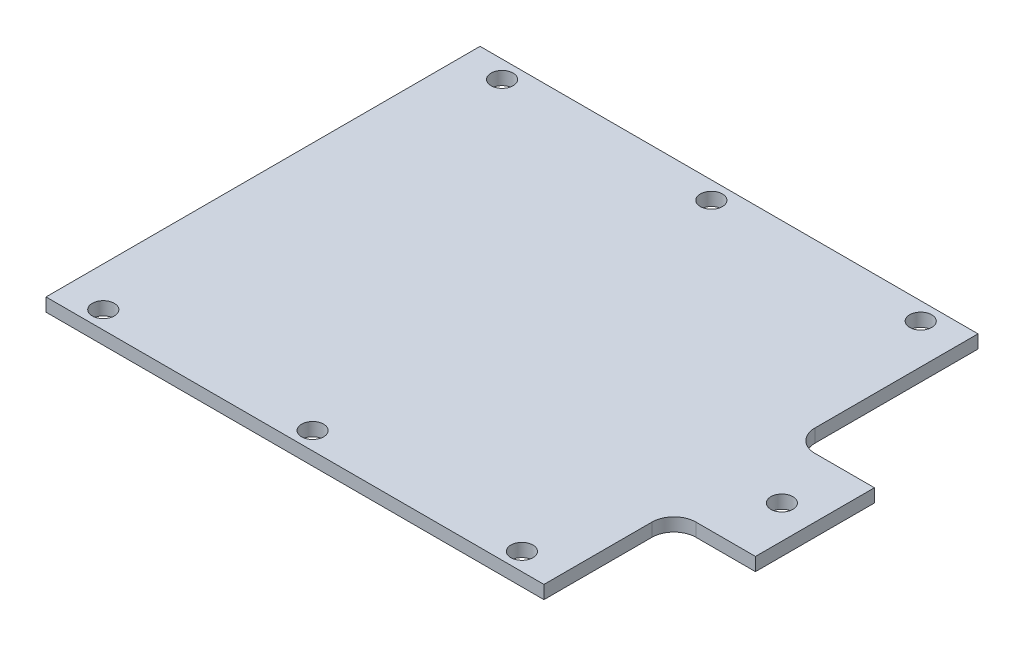
ISO-10303-21;
HEADER;
FILE_DESCRIPTION(('STEP AP214'),'2;1');
FILE_NAME('part.step','',(''),(''),'','','');
FILE_SCHEMA(('AUTOMOTIVE_DESIGN { 1 0 10303 214 1 1 1 1 }'));
ENDSEC;
DATA;
#1=APPLICATION_CONTEXT('core data for automotive mechanical design processes');
#2=APPLICATION_PROTOCOL_DEFINITION('international standard','automotive_design',2000,#1);
#3=PRODUCT_CONTEXT('',#1,'mechanical');
#4=PRODUCT('Part','Part','',(#3));
#5=PRODUCT_RELATED_PRODUCT_CATEGORY('part','',(#4));
#6=PRODUCT_DEFINITION_FORMATION('','',#4);
#7=PRODUCT_DEFINITION_CONTEXT('part definition',#1,'design');
#8=PRODUCT_DEFINITION('design','',#6,#7);
#9=PRODUCT_DEFINITION_SHAPE('','',#8);
#10=(LENGTH_UNIT() NAMED_UNIT(*) SI_UNIT(.MILLI.,.METRE.));
#11=(NAMED_UNIT(*) PLANE_ANGLE_UNIT() SI_UNIT($,.RADIAN.));
#12=(NAMED_UNIT(*) SI_UNIT($,.STERADIAN.) SOLID_ANGLE_UNIT());
#13=UNCERTAINTY_MEASURE_WITH_UNIT(LENGTH_MEASURE(1.E-05),#10,'distance_accuracy_value','');
#14=(GEOMETRIC_REPRESENTATION_CONTEXT(3) GLOBAL_UNCERTAINTY_ASSIGNED_CONTEXT((#13)) GLOBAL_UNIT_ASSIGNED_CONTEXT((#10,
#11,#12)) REPRESENTATION_CONTEXT('',''));
#15=CARTESIAN_POINT('',(0.,0.,0.));
#16=DIRECTION('',(0.,0.,1.));
#17=DIRECTION('',(1.,0.,0.));
#18=AXIS2_PLACEMENT_3D('',#15,#16,#17);
#19=CARTESIAN_POINT('',(0.,0.,0.));
#20=DIRECTION('',(0.,1.,0.));
#21=DIRECTION('',(0.,0.,1.));
#22=AXIS2_PLACEMENT_3D('',#19,#20,#21);
#23=PLANE('',#22);
#24=CARTESIAN_POINT('',(95.,0.,90.5));
#25=DIRECTION('',(0.,1.,0.));
#26=DIRECTION('',(0.,0.,1.));
#27=AXIS2_PLACEMENT_3D('',#24,#25,#26);
#28=CIRCLE('',#27,5.);
#29=CARTESIAN_POINT('',(95.,0.,95.5));
#30=VERTEX_POINT('',#29);
#31=EDGE_CURVE('E125',#30,#30,#28,.T.);
#32=ORIENTED_EDGE('',*,*,#31,.T.);
#33=EDGE_LOOP('',(#32));
#34=FACE_BOUND('',#33,.T.);
#35=CARTESIAN_POINT('',(0.,0.,90.5));
#36=DIRECTION('',(0.,1.,0.));
#37=DIRECTION('',(0.,0.,1.));
#38=AXIS2_PLACEMENT_3D('',#35,#36,#37);
#39=CIRCLE('',#38,5.);
#40=CARTESIAN_POINT('',(0.,0.,95.5));
#41=VERTEX_POINT('',#40);
#42=EDGE_CURVE('E201',#41,#41,#39,.T.);
#43=ORIENTED_EDGE('',*,*,#42,.T.);
#44=EDGE_LOOP('',(#43));
#45=FACE_BOUND('',#44,.T.);
#46=CARTESIAN_POINT('',(-95.,0.,90.5));
#47=DIRECTION('',(0.,1.,0.));
#48=DIRECTION('',(0.,0.,1.));
#49=AXIS2_PLACEMENT_3D('',#46,#47,#48);
#50=CIRCLE('',#49,5.);
#51=CARTESIAN_POINT('',(-95.,0.,95.5));
#52=VERTEX_POINT('',#51);
#53=EDGE_CURVE('E204',#52,#52,#50,.T.);
#54=ORIENTED_EDGE('',*,*,#53,.T.);
#55=EDGE_LOOP('',(#54));
#56=FACE_BOUND('',#55,.T.);
#57=CARTESIAN_POINT('',(135.,0.,12.5));
#58=DIRECTION('',(0.,1.,0.));
#59=DIRECTION('',(0.,0.,1.));
#60=AXIS2_PLACEMENT_3D('',#57,#58,#59);
#61=CIRCLE('',#60,5.);
#62=CARTESIAN_POINT('',(135.,0.,17.5));
#63=VERTEX_POINT('',#62);
#64=EDGE_CURVE('E207',#63,#63,#61,.T.);
#65=ORIENTED_EDGE('',*,*,#64,.T.);
#66=EDGE_LOOP('',(#65));
#67=FACE_BOUND('',#66,.T.);
#68=CARTESIAN_POINT('',(95.,0.,-90.5));
#69=DIRECTION('',(0.,1.,0.));
#70=DIRECTION('',(0.,0.,1.));
#71=AXIS2_PLACEMENT_3D('',#68,#69,#70);
#72=CIRCLE('',#71,5.);
#73=CARTESIAN_POINT('',(95.,0.,-85.5));
#74=VERTEX_POINT('',#73);
#75=EDGE_CURVE('E210',#74,#74,#72,.T.);
#76=ORIENTED_EDGE('',*,*,#75,.T.);
#77=EDGE_LOOP('',(#76));
#78=FACE_BOUND('',#77,.T.);
#79=CARTESIAN_POINT('',(0.,0.,-90.5));
#80=DIRECTION('',(0.,1.,0.));
#81=DIRECTION('',(0.,0.,1.));
#82=AXIS2_PLACEMENT_3D('',#79,#80,#81);
#83=CIRCLE('',#82,5.);
#84=CARTESIAN_POINT('',(0.,0.,-85.5));
#85=VERTEX_POINT('',#84);
#86=EDGE_CURVE('E213',#85,#85,#83,.T.);
#87=ORIENTED_EDGE('',*,*,#86,.T.);
#88=EDGE_LOOP('',(#87));
#89=FACE_BOUND('',#88,.T.);
#90=CARTESIAN_POINT('',(-95.,0.,-90.5));
#91=DIRECTION('',(0.,1.,0.));
#92=DIRECTION('',(0.,0.,1.));
#93=AXIS2_PLACEMENT_3D('',#90,#91,#92);
#94=CIRCLE('',#93,5.);
#95=CARTESIAN_POINT('',(-95.,0.,-85.5));
#96=VERTEX_POINT('',#95);
#97=EDGE_CURVE('E147',#96,#96,#94,.T.);
#98=ORIENTED_EDGE('',*,*,#97,.T.);
#99=EDGE_LOOP('',(#98));
#100=FACE_BOUND('',#99,.T.);
#101=DIRECTION('',(0.,0.,-1.));
#102=VECTOR('',#101,1.);
#103=CARTESIAN_POINT('',(113.,0.,-24.5));
#104=LINE('',#103,#102);
#105=CARTESIAN_POINT('',(113.,0.,-24.5));
#106=VERTEX_POINT('',#105);
#107=CARTESIAN_POINT('',(113.,0.,-98.5));
#108=VERTEX_POINT('',#107);
#109=EDGE_CURVE('E150',#106,#108,#104,.T.);
#110=ORIENTED_EDGE('',*,*,#109,.F.);
#111=CARTESIAN_POINT('',(123.,0.,-24.5));
#112=DIRECTION('',(0.,1.,0.));
#113=DIRECTION('',(0.,0.,1.));
#114=AXIS2_PLACEMENT_3D('',#111,#112,#113);
#115=CIRCLE('',#114,10.);
#116=CARTESIAN_POINT('',(123.,0.,-14.5));
#117=VERTEX_POINT('',#116);
#118=EDGE_CURVE('E162',#106,#117,#115,.T.);
#119=ORIENTED_EDGE('',*,*,#118,.T.);
#120=DIRECTION('',(-1.,0.,0.));
#121=VECTOR('',#120,1.);
#122=CARTESIAN_POINT('',(150.,0.,-14.5));
#123=LINE('',#122,#121);
#124=CARTESIAN_POINT('',(150.,0.,-14.5));
#125=VERTEX_POINT('',#124);
#126=EDGE_CURVE('E159',#125,#117,#123,.T.);
#127=ORIENTED_EDGE('',*,*,#126,.F.);
#128=DIRECTION('',(0.,0.,-1.));
#129=VECTOR('',#128,1.);
#130=CARTESIAN_POINT('',(150.,0.,39.5));
#131=LINE('',#130,#129);
#132=CARTESIAN_POINT('',(150.,0.,39.5));
#133=VERTEX_POINT('',#132);
#134=EDGE_CURVE('E166',#133,#125,#131,.T.);
#135=ORIENTED_EDGE('',*,*,#134,.F.);
#136=DIRECTION('',(1.,0.,0.));
#137=VECTOR('',#136,1.);
#138=CARTESIAN_POINT('',(123.,0.,39.5));
#139=LINE('',#138,#137);
#140=CARTESIAN_POINT('',(123.,0.,39.5));
#141=VERTEX_POINT('',#140);
#142=EDGE_CURVE('E99',#141,#133,#139,.T.);
#143=ORIENTED_EDGE('',*,*,#142,.F.);
#144=CARTESIAN_POINT('',(123.,0.,49.5));
#145=DIRECTION('',(0.,1.,0.));
#146=DIRECTION('',(0.,0.,1.));
#147=AXIS2_PLACEMENT_3D('',#144,#145,#146);
#148=CIRCLE('',#147,10.);
#149=CARTESIAN_POINT('',(113.,0.,49.5));
#150=VERTEX_POINT('',#149);
#151=EDGE_CURVE('E20',#141,#150,#148,.T.);
#152=ORIENTED_EDGE('',*,*,#151,.T.);
#153=DIRECTION('',(0.,0.,-1.));
#154=VECTOR('',#153,1.);
#155=CARTESIAN_POINT('',(113.,0.,98.5));
#156=LINE('',#155,#154);
#157=CARTESIAN_POINT('',(113.,0.,98.5));
#158=VERTEX_POINT('',#157);
#159=EDGE_CURVE('E96',#158,#150,#156,.T.);
#160=ORIENTED_EDGE('',*,*,#159,.F.);
#161=DIRECTION('',(1.,0.,0.));
#162=VECTOR('',#161,1.);
#163=CARTESIAN_POINT('',(-113.,0.,98.5));
#164=LINE('',#163,#162);
#165=CARTESIAN_POINT('',(-113.,0.,98.5));
#166=VERTEX_POINT('',#165);
#167=EDGE_CURVE('E118',#166,#158,#164,.T.);
#168=ORIENTED_EDGE('',*,*,#167,.F.);
#169=DIRECTION('',(0.,0.,1.));
#170=VECTOR('',#169,1.);
#171=CARTESIAN_POINT('',(-113.,0.,-98.5));
#172=LINE('',#171,#170);
#173=CARTESIAN_POINT('',(-113.,0.,-98.5));
#174=VERTEX_POINT('',#173);
#175=EDGE_CURVE('E144',#174,#166,#172,.T.);
#176=ORIENTED_EDGE('',*,*,#175,.F.);
#177=DIRECTION('',(-1.,0.,0.));
#178=VECTOR('',#177,1.);
#179=CARTESIAN_POINT('',(113.,0.,-98.5));
#180=LINE('',#179,#178);
#181=EDGE_CURVE('E131',#108,#174,#180,.T.);
#182=ORIENTED_EDGE('',*,*,#181,.F.);
#183=EDGE_LOOP('',(#110,#119,#127,#135,#143,#152,#160,#168,#176,#182));
#184=FACE_BOUND('',#183,.T.);
#185=ADVANCED_FACE('F17',(#34,#45,#56,#67,#78,#89,#100,#184),#23,.F.);
#186=CARTESIAN_POINT('',(-113.,0.,98.5));
#187=DIRECTION('',(0.,0.,1.));
#188=DIRECTION('',(1.,0.,0.));
#189=AXIS2_PLACEMENT_3D('',#186,#187,#188);
#190=PLANE('',#189);
#191=DIRECTION('',(0.,1.,0.));
#192=VECTOR('',#191,1.);
#193=CARTESIAN_POINT('',(-113.,0.,98.5));
#194=LINE('',#193,#192);
#195=CARTESIAN_POINT('',(-113.,6.,98.5));
#196=VERTEX_POINT('',#195);
#197=EDGE_CURVE('E128',#166,#196,#194,.T.);
#198=ORIENTED_EDGE('',*,*,#197,.F.);
#199=ORIENTED_EDGE('',*,*,#167,.T.);
#200=DIRECTION('',(0.,1.,0.));
#201=VECTOR('',#200,1.);
#202=CARTESIAN_POINT('',(113.,0.,98.5));
#203=LINE('',#202,#201);
#204=CARTESIAN_POINT('',(113.,6.,98.5));
#205=VERTEX_POINT('',#204);
#206=EDGE_CURVE('E106',#205,#158,#203,.F.);
#207=ORIENTED_EDGE('',*,*,#206,.F.);
#208=DIRECTION('',(1.,0.,0.));
#209=VECTOR('',#208,1.);
#210=CARTESIAN_POINT('',(0.,6.,98.5));
#211=LINE('',#210,#209);
#212=EDGE_CURVE('E121',#196,#205,#211,.T.);
#213=ORIENTED_EDGE('',*,*,#212,.F.);
#214=EDGE_LOOP('',(#198,#199,#207,#213));
#215=FACE_BOUND('',#214,.T.);
#216=ADVANCED_FACE('F436',(#215),#190,.T.);
#217=CARTESIAN_POINT('',(113.,0.,98.5));
#218=DIRECTION('',(1.,0.,0.));
#219=DIRECTION('',(0.,0.,-1.));
#220=AXIS2_PLACEMENT_3D('',#217,#218,#219);
#221=PLANE('',#220);
#222=ORIENTED_EDGE('',*,*,#206,.T.);
#223=ORIENTED_EDGE('',*,*,#159,.T.);
#224=DIRECTION('',(0.,1.,0.));
#225=VECTOR('',#224,1.);
#226=CARTESIAN_POINT('',(113.,0.,49.5));
#227=LINE('',#226,#225);
#228=CARTESIAN_POINT('',(113.,6.,49.5));
#229=VERTEX_POINT('',#228);
#230=EDGE_CURVE('E101',#150,#229,#227,.T.);
#231=ORIENTED_EDGE('',*,*,#230,.T.);
#232=DIRECTION('',(0.,0.,1.));
#233=VECTOR('',#232,1.);
#234=CARTESIAN_POINT('',(113.,6.,0.));
#235=LINE('',#234,#233);
#236=EDGE_CURVE('E124',#205,#229,#235,.F.);
#237=ORIENTED_EDGE('',*,*,#236,.F.);
#238=EDGE_LOOP('',(#222,#223,#231,#237));
#239=FACE_BOUND('',#238,.T.);
#240=ADVANCED_FACE('F103',(#239),#221,.T.);
#241=CARTESIAN_POINT('',(123.,0.,49.5));
#242=DIRECTION('',(0.,1.,0.));
#243=DIRECTION('',(0.,0.,1.));
#244=AXIS2_PLACEMENT_3D('',#241,#242,#243);
#245=CYLINDRICAL_SURFACE('',#244,10.);
#246=CARTESIAN_POINT('',(123.,6.,49.5));
#247=DIRECTION('',(0.,1.,0.));
#248=DIRECTION('',(0.,0.,1.));
#249=AXIS2_PLACEMENT_3D('',#246,#247,#248);
#250=CIRCLE('',#249,10.);
#251=CARTESIAN_POINT('',(123.,6.,39.5));
#252=VERTEX_POINT('',#251);
#253=EDGE_CURVE('E110',#229,#252,#250,.F.);
#254=ORIENTED_EDGE('',*,*,#253,.F.);
#255=ORIENTED_EDGE('',*,*,#230,.F.);
#256=ORIENTED_EDGE('',*,*,#151,.F.);
#257=DIRECTION('',(0.,1.,0.));
#258=VECTOR('',#257,1.);
#259=CARTESIAN_POINT('',(123.,0.,39.5));
#260=LINE('',#259,#258);
#261=EDGE_CURVE('E112',#252,#141,#260,.F.);
#262=ORIENTED_EDGE('',*,*,#261,.F.);
#263=EDGE_LOOP('',(#254,#255,#256,#262));
#264=FACE_BOUND('',#263,.T.);
#265=ADVANCED_FACE('F108',(#264),#245,.F.);
#266=CARTESIAN_POINT('',(123.,0.,39.5));
#267=DIRECTION('',(0.,0.,1.));
#268=DIRECTION('',(1.,0.,0.));
#269=AXIS2_PLACEMENT_3D('',#266,#267,#268);
#270=PLANE('',#269);
#271=ORIENTED_EDGE('',*,*,#261,.T.);
#272=ORIENTED_EDGE('',*,*,#142,.T.);
#273=DIRECTION('',(0.,1.,0.));
#274=VECTOR('',#273,1.);
#275=CARTESIAN_POINT('',(150.,0.,39.5));
#276=LINE('',#275,#274);
#277=CARTESIAN_POINT('',(150.,6.,39.5));
#278=VERTEX_POINT('',#277);
#279=EDGE_CURVE('E168',#278,#133,#276,.F.);
#280=ORIENTED_EDGE('',*,*,#279,.F.);
#281=DIRECTION('',(1.,0.,0.));
#282=VECTOR('',#281,1.);
#283=CARTESIAN_POINT('',(0.,6.,39.5));
#284=LINE('',#283,#282);
#285=EDGE_CURVE('E198',#252,#278,#284,.T.);
#286=ORIENTED_EDGE('',*,*,#285,.F.);
#287=EDGE_LOOP('',(#271,#272,#280,#286));
#288=FACE_BOUND('',#287,.T.);
#289=ADVANCED_FACE('F247',(#288),#270,.T.);
#290=CARTESIAN_POINT('',(150.,0.,39.5));
#291=DIRECTION('',(1.,0.,0.));
#292=DIRECTION('',(0.,0.,-1.));
#293=AXIS2_PLACEMENT_3D('',#290,#291,#292);
#294=PLANE('',#293);
#295=ORIENTED_EDGE('',*,*,#279,.T.);
#296=ORIENTED_EDGE('',*,*,#134,.T.);
#297=DIRECTION('',(0.,1.,0.));
#298=VECTOR('',#297,1.);
#299=CARTESIAN_POINT('',(150.,0.,-14.5));
#300=LINE('',#299,#298);
#301=CARTESIAN_POINT('',(150.,6.,-14.5));
#302=VERTEX_POINT('',#301);
#303=EDGE_CURVE('E163',#302,#125,#300,.F.);
#304=ORIENTED_EDGE('',*,*,#303,.F.);
#305=DIRECTION('',(0.,0.,1.));
#306=VECTOR('',#305,1.);
#307=CARTESIAN_POINT('',(150.,6.,0.));
#308=LINE('',#307,#306);
#309=EDGE_CURVE('E234',#278,#302,#308,.F.);
#310=ORIENTED_EDGE('',*,*,#309,.F.);
#311=EDGE_LOOP('',(#295,#296,#304,#310));
#312=FACE_BOUND('',#311,.T.);
#313=ADVANCED_FACE('F243',(#312),#294,.T.);
#314=CARTESIAN_POINT('',(150.,0.,-14.5));
#315=DIRECTION('',(0.,0.,-1.));
#316=DIRECTION('',(-1.,0.,0.));
#317=AXIS2_PLACEMENT_3D('',#314,#315,#316);
#318=PLANE('',#317);
#319=ORIENTED_EDGE('',*,*,#303,.T.);
#320=ORIENTED_EDGE('',*,*,#126,.T.);
#321=DIRECTION('',(0.,1.,0.));
#322=VECTOR('',#321,1.);
#323=CARTESIAN_POINT('',(123.,0.,-14.5));
#324=LINE('',#323,#322);
#325=CARTESIAN_POINT('',(123.,6.,-14.5));
#326=VERTEX_POINT('',#325);
#327=EDGE_CURVE('E217',#117,#326,#324,.T.);
#328=ORIENTED_EDGE('',*,*,#327,.T.);
#329=DIRECTION('',(1.,0.,0.));
#330=VECTOR('',#329,1.);
#331=CARTESIAN_POINT('',(0.,6.,-14.5));
#332=LINE('',#331,#330);
#333=EDGE_CURVE('E196',#302,#326,#332,.F.);
#334=ORIENTED_EDGE('',*,*,#333,.F.);
#335=EDGE_LOOP('',(#319,#320,#328,#334));
#336=FACE_BOUND('',#335,.T.);
#337=ADVANCED_FACE('F248',(#336),#318,.T.);
#338=CARTESIAN_POINT('',(123.,0.,-24.5));
#339=DIRECTION('',(0.,1.,0.));
#340=DIRECTION('',(0.,0.,1.));
#341=AXIS2_PLACEMENT_3D('',#338,#339,#340);
#342=CYLINDRICAL_SURFACE('',#341,10.);
#343=CARTESIAN_POINT('',(123.,6.,-24.5));
#344=DIRECTION('',(0.,1.,0.));
#345=DIRECTION('',(0.,0.,1.));
#346=AXIS2_PLACEMENT_3D('',#343,#344,#345);
#347=CIRCLE('',#346,10.);
#348=CARTESIAN_POINT('',(113.,6.,-24.5));
#349=VERTEX_POINT('',#348);
#350=EDGE_CURVE('E192',#326,#349,#347,.F.);
#351=ORIENTED_EDGE('',*,*,#350,.F.);
#352=ORIENTED_EDGE('',*,*,#327,.F.);
#353=ORIENTED_EDGE('',*,*,#118,.F.);
#354=DIRECTION('',(0.,1.,0.));
#355=VECTOR('',#354,1.);
#356=CARTESIAN_POINT('',(113.,0.,-24.5));
#357=LINE('',#356,#355);
#358=EDGE_CURVE('E153',#349,#106,#357,.F.);
#359=ORIENTED_EDGE('',*,*,#358,.F.);
#360=EDGE_LOOP('',(#351,#352,#353,#359));
#361=FACE_BOUND('',#360,.T.);
#362=ADVANCED_FACE('F281',(#361),#342,.F.);
#363=CARTESIAN_POINT('',(113.,0.,-24.5));
#364=DIRECTION('',(1.,0.,0.));
#365=DIRECTION('',(0.,0.,-1.));
#366=AXIS2_PLACEMENT_3D('',#363,#364,#365);
#367=PLANE('',#366);
#368=ORIENTED_EDGE('',*,*,#358,.T.);
#369=ORIENTED_EDGE('',*,*,#109,.T.);
#370=DIRECTION('',(0.,1.,0.));
#371=VECTOR('',#370,1.);
#372=CARTESIAN_POINT('',(113.,0.,-98.5));
#373=LINE('',#372,#371);
#374=CARTESIAN_POINT('',(113.,6.,-98.5));
#375=VERTEX_POINT('',#374);
#376=EDGE_CURVE('E152',#375,#108,#373,.F.);
#377=ORIENTED_EDGE('',*,*,#376,.F.);
#378=DIRECTION('',(0.,0.,1.));
#379=VECTOR('',#378,1.);
#380=CARTESIAN_POINT('',(113.,6.,0.));
#381=LINE('',#380,#379);
#382=EDGE_CURVE('E195',#349,#375,#381,.F.);
#383=ORIENTED_EDGE('',*,*,#382,.F.);
#384=EDGE_LOOP('',(#368,#369,#377,#383));
#385=FACE_BOUND('',#384,.T.);
#386=ADVANCED_FACE('F273',(#385),#367,.T.);
#387=CARTESIAN_POINT('',(113.,0.,-98.5));
#388=DIRECTION('',(0.,0.,-1.));
#389=DIRECTION('',(-1.,0.,0.));
#390=AXIS2_PLACEMENT_3D('',#387,#388,#389);
#391=PLANE('',#390);
#392=ORIENTED_EDGE('',*,*,#376,.T.);
#393=ORIENTED_EDGE('',*,*,#181,.T.);
#394=DIRECTION('',(0.,1.,0.));
#395=VECTOR('',#394,1.);
#396=CARTESIAN_POINT('',(-113.,0.,-98.5));
#397=LINE('',#396,#395);
#398=CARTESIAN_POINT('',(-113.,6.,-98.5));
#399=VERTEX_POINT('',#398);
#400=EDGE_CURVE('E35',#399,#174,#397,.F.);
#401=ORIENTED_EDGE('',*,*,#400,.F.);
#402=DIRECTION('',(1.,0.,0.));
#403=VECTOR('',#402,1.);
#404=CARTESIAN_POINT('',(0.,6.,-98.5));
#405=LINE('',#404,#403);
#406=EDGE_CURVE('E138',#375,#399,#405,.F.);
#407=ORIENTED_EDGE('',*,*,#406,.F.);
#408=EDGE_LOOP('',(#392,#393,#401,#407));
#409=FACE_BOUND('',#408,.T.);
#410=ADVANCED_FACE('F267',(#409),#391,.T.);
#411=CARTESIAN_POINT('',(-113.,0.,-98.5));
#412=DIRECTION('',(-1.,0.,0.));
#413=DIRECTION('',(0.,0.,1.));
#414=AXIS2_PLACEMENT_3D('',#411,#412,#413);
#415=PLANE('',#414);
#416=ORIENTED_EDGE('',*,*,#400,.T.);
#417=ORIENTED_EDGE('',*,*,#175,.T.);
#418=ORIENTED_EDGE('',*,*,#197,.T.);
#419=DIRECTION('',(0.,0.,1.));
#420=VECTOR('',#419,1.);
#421=CARTESIAN_POINT('',(-113.,6.,0.));
#422=LINE('',#421,#420);
#423=EDGE_CURVE('E134',#399,#196,#422,.T.);
#424=ORIENTED_EDGE('',*,*,#423,.F.);
#425=EDGE_LOOP('',(#416,#417,#418,#424));
#426=FACE_BOUND('',#425,.T.);
#427=ADVANCED_FACE('F276',(#426),#415,.T.);
#428=CARTESIAN_POINT('',(-95.,0.,-90.5));
#429=DIRECTION('',(0.,1.,0.));
#430=DIRECTION('',(0.,0.,1.));
#431=AXIS2_PLACEMENT_3D('',#428,#429,#430);
#432=CYLINDRICAL_SURFACE('',#431,5.);
#433=CARTESIAN_POINT('',(-95.,6.,-90.5));
#434=DIRECTION('',(0.,1.,0.));
#435=DIRECTION('',(0.,0.,1.));
#436=AXIS2_PLACEMENT_3D('',#433,#434,#435);
#437=CIRCLE('',#436,5.);
#438=CARTESIAN_POINT('',(-95.,6.,-85.5));
#439=VERTEX_POINT('',#438);
#440=EDGE_CURVE('E137',#439,#439,#437,.F.);
#441=ORIENTED_EDGE('',*,*,#440,.F.);
#442=EDGE_LOOP('',(#441));
#443=FACE_BOUND('',#442,.T.);
#444=ORIENTED_EDGE('',*,*,#97,.F.);
#445=EDGE_LOOP('',(#444));
#446=FACE_BOUND('',#445,.T.);
#447=ADVANCED_FACE('F321',(#443,#446),#432,.F.);
#448=CARTESIAN_POINT('',(0.,0.,-90.5));
#449=DIRECTION('',(0.,1.,0.));
#450=DIRECTION('',(0.,0.,1.));
#451=AXIS2_PLACEMENT_3D('',#448,#449,#450);
#452=CYLINDRICAL_SURFACE('',#451,5.);
#453=CARTESIAN_POINT('',(0.,6.,-90.5));
#454=DIRECTION('',(0.,1.,0.));
#455=DIRECTION('',(0.,0.,1.));
#456=AXIS2_PLACEMENT_3D('',#453,#454,#455);
#457=CIRCLE('',#456,5.);
#458=CARTESIAN_POINT('',(0.,6.,-85.5));
#459=VERTEX_POINT('',#458);
#460=EDGE_CURVE('E187',#459,#459,#457,.F.);
#461=ORIENTED_EDGE('',*,*,#460,.F.);
#462=EDGE_LOOP('',(#461));
#463=FACE_BOUND('',#462,.T.);
#464=ORIENTED_EDGE('',*,*,#86,.F.);
#465=EDGE_LOOP('',(#464));
#466=FACE_BOUND('',#465,.T.);
#467=ADVANCED_FACE('F317',(#463,#466),#452,.F.);
#468=CARTESIAN_POINT('',(95.,0.,-90.5));
#469=DIRECTION('',(0.,1.,0.));
#470=DIRECTION('',(0.,0.,1.));
#471=AXIS2_PLACEMENT_3D('',#468,#469,#470);
#472=CYLINDRICAL_SURFACE('',#471,5.);
#473=CARTESIAN_POINT('',(95.,6.,-90.5));
#474=DIRECTION('',(0.,1.,0.));
#475=DIRECTION('',(0.,0.,1.));
#476=AXIS2_PLACEMENT_3D('',#473,#474,#475);
#477=CIRCLE('',#476,5.);
#478=CARTESIAN_POINT('',(95.,6.,-85.5));
#479=VERTEX_POINT('',#478);
#480=EDGE_CURVE('E184',#479,#479,#477,.F.);
#481=ORIENTED_EDGE('',*,*,#480,.F.);
#482=EDGE_LOOP('',(#481));
#483=FACE_BOUND('',#482,.T.);
#484=ORIENTED_EDGE('',*,*,#75,.F.);
#485=EDGE_LOOP('',(#484));
#486=FACE_BOUND('',#485,.T.);
#487=ADVANCED_FACE('F313',(#483,#486),#472,.F.);
#488=CARTESIAN_POINT('',(135.,0.,12.5));
#489=DIRECTION('',(0.,1.,0.));
#490=DIRECTION('',(0.,0.,1.));
#491=AXIS2_PLACEMENT_3D('',#488,#489,#490);
#492=CYLINDRICAL_SURFACE('',#491,5.);
#493=CARTESIAN_POINT('',(135.,6.,12.5));
#494=DIRECTION('',(0.,1.,0.));
#495=DIRECTION('',(0.,0.,1.));
#496=AXIS2_PLACEMENT_3D('',#493,#494,#495);
#497=CIRCLE('',#496,5.);
#498=CARTESIAN_POINT('',(135.,6.,17.5));
#499=VERTEX_POINT('',#498);
#500=EDGE_CURVE('E181',#499,#499,#497,.F.);
#501=ORIENTED_EDGE('',*,*,#500,.F.);
#502=EDGE_LOOP('',(#501));
#503=FACE_BOUND('',#502,.T.);
#504=ORIENTED_EDGE('',*,*,#64,.F.);
#505=EDGE_LOOP('',(#504));
#506=FACE_BOUND('',#505,.T.);
#507=ADVANCED_FACE('F309',(#503,#506),#492,.F.);
#508=CARTESIAN_POINT('',(-95.,0.,90.5));
#509=DIRECTION('',(0.,1.,0.));
#510=DIRECTION('',(0.,0.,1.));
#511=AXIS2_PLACEMENT_3D('',#508,#509,#510);
#512=CYLINDRICAL_SURFACE('',#511,5.);
#513=CARTESIAN_POINT('',(-95.,6.,90.5));
#514=DIRECTION('',(0.,1.,0.));
#515=DIRECTION('',(0.,0.,1.));
#516=AXIS2_PLACEMENT_3D('',#513,#514,#515);
#517=CIRCLE('',#516,5.);
#518=CARTESIAN_POINT('',(-95.,6.,95.5));
#519=VERTEX_POINT('',#518);
#520=EDGE_CURVE('E178',#519,#519,#517,.F.);
#521=ORIENTED_EDGE('',*,*,#520,.F.);
#522=EDGE_LOOP('',(#521));
#523=FACE_BOUND('',#522,.T.);
#524=ORIENTED_EDGE('',*,*,#53,.F.);
#525=EDGE_LOOP('',(#524));
#526=FACE_BOUND('',#525,.T.);
#527=ADVANCED_FACE('F305',(#523,#526),#512,.F.);
#528=CARTESIAN_POINT('',(0.,0.,90.5));
#529=DIRECTION('',(0.,1.,0.));
#530=DIRECTION('',(0.,0.,1.));
#531=AXIS2_PLACEMENT_3D('',#528,#529,#530);
#532=CYLINDRICAL_SURFACE('',#531,5.);
#533=CARTESIAN_POINT('',(0.,6.,90.5));
#534=DIRECTION('',(0.,1.,0.));
#535=DIRECTION('',(0.,0.,1.));
#536=AXIS2_PLACEMENT_3D('',#533,#534,#535);
#537=CIRCLE('',#536,5.);
#538=CARTESIAN_POINT('',(0.,6.,95.5));
#539=VERTEX_POINT('',#538);
#540=EDGE_CURVE('E26',#539,#539,#537,.F.);
#541=ORIENTED_EDGE('',*,*,#540,.F.);
#542=EDGE_LOOP('',(#541));
#543=FACE_BOUND('',#542,.T.);
#544=ORIENTED_EDGE('',*,*,#42,.F.);
#545=EDGE_LOOP('',(#544));
#546=FACE_BOUND('',#545,.T.);
#547=ADVANCED_FACE('F298',(#543,#546),#532,.F.);
#548=CARTESIAN_POINT('',(95.,0.,90.5));
#549=DIRECTION('',(0.,1.,0.));
#550=DIRECTION('',(0.,0.,1.));
#551=AXIS2_PLACEMENT_3D('',#548,#549,#550);
#552=CYLINDRICAL_SURFACE('',#551,5.);
#553=CARTESIAN_POINT('',(95.,6.,90.5));
#554=DIRECTION('',(0.,1.,0.));
#555=DIRECTION('',(0.,0.,1.));
#556=AXIS2_PLACEMENT_3D('',#553,#554,#555);
#557=CIRCLE('',#556,5.);
#558=CARTESIAN_POINT('',(95.,6.,95.5));
#559=VERTEX_POINT('',#558);
#560=EDGE_CURVE('E11',#559,#559,#557,.F.);
#561=ORIENTED_EDGE('',*,*,#560,.F.);
#562=EDGE_LOOP('',(#561));
#563=FACE_BOUND('',#562,.T.);
#564=ORIENTED_EDGE('',*,*,#31,.F.);
#565=EDGE_LOOP('',(#564));
#566=FACE_BOUND('',#565,.T.);
#567=ADVANCED_FACE('F292',(#563,#566),#552,.F.);
#568=CARTESIAN_POINT('',(0.,6.,0.));
#569=DIRECTION('',(0.,1.,0.));
#570=DIRECTION('',(0.,0.,1.));
#571=AXIS2_PLACEMENT_3D('',#568,#569,#570);
#572=PLANE('',#571);
#573=ORIENTED_EDGE('',*,*,#560,.T.);
#574=EDGE_LOOP('',(#573));
#575=FACE_BOUND('',#574,.T.);
#576=ORIENTED_EDGE('',*,*,#540,.T.);
#577=EDGE_LOOP('',(#576));
#578=FACE_BOUND('',#577,.T.);
#579=ORIENTED_EDGE('',*,*,#520,.T.);
#580=EDGE_LOOP('',(#579));
#581=FACE_BOUND('',#580,.T.);
#582=ORIENTED_EDGE('',*,*,#500,.T.);
#583=EDGE_LOOP('',(#582));
#584=FACE_BOUND('',#583,.T.);
#585=ORIENTED_EDGE('',*,*,#480,.T.);
#586=EDGE_LOOP('',(#585));
#587=FACE_BOUND('',#586,.T.);
#588=ORIENTED_EDGE('',*,*,#460,.T.);
#589=EDGE_LOOP('',(#588));
#590=FACE_BOUND('',#589,.T.);
#591=ORIENTED_EDGE('',*,*,#440,.T.);
#592=EDGE_LOOP('',(#591));
#593=FACE_BOUND('',#592,.T.);
#594=ORIENTED_EDGE('',*,*,#406,.T.);
#595=ORIENTED_EDGE('',*,*,#423,.T.);
#596=ORIENTED_EDGE('',*,*,#212,.T.);
#597=ORIENTED_EDGE('',*,*,#236,.T.);
#598=ORIENTED_EDGE('',*,*,#253,.T.);
#599=ORIENTED_EDGE('',*,*,#285,.T.);
#600=ORIENTED_EDGE('',*,*,#309,.T.);
#601=ORIENTED_EDGE('',*,*,#333,.T.);
#602=ORIENTED_EDGE('',*,*,#350,.T.);
#603=ORIENTED_EDGE('',*,*,#382,.T.);
#604=EDGE_LOOP('',(#594,#595,#596,#597,#598,#599,#600,#601,#602,#603));
#605=FACE_BOUND('',#604,.T.);
#606=ADVANCED_FACE('F253',(#575,#578,#581,#584,#587,#590,#593,#605),#572,.T.);
#607=CLOSED_SHELL('',(#185,#216,#240,#265,#289,#313,#337,#362,#386,#410,#427,#447,#467,#487,
#507,#527,#547,#567,#606));
#608=MANIFOLD_SOLID_BREP('B1',#607);
#609=ADVANCED_BREP_SHAPE_REPRESENTATION('',(#18,#608),#14);
#610=SHAPE_DEFINITION_REPRESENTATION(#9,#609);
ENDSEC;
END-ISO-10303-21;
